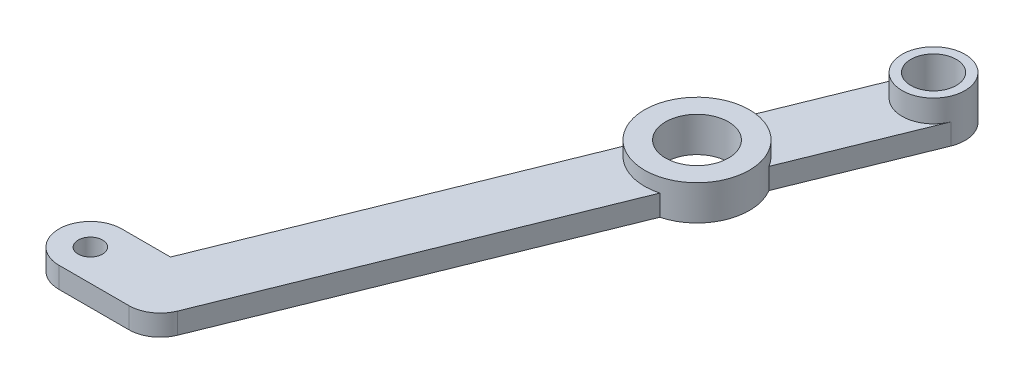
ISO-10303-21;
HEADER;
FILE_DESCRIPTION(('STEP AP214'),'2;1');
FILE_NAME('part.step','',(''),(''),'','','');
FILE_SCHEMA(('AUTOMOTIVE_DESIGN { 1 0 10303 214 1 1 1 1 }'));
ENDSEC;
DATA;
#1=APPLICATION_CONTEXT('core data for automotive mechanical design processes');
#2=APPLICATION_PROTOCOL_DEFINITION('international standard','automotive_design',2000,#1);
#3=PRODUCT_CONTEXT('',#1,'mechanical');
#4=PRODUCT('Part','Part','',(#3));
#5=PRODUCT_RELATED_PRODUCT_CATEGORY('part','',(#4));
#6=PRODUCT_DEFINITION_FORMATION('','',#4);
#7=PRODUCT_DEFINITION_CONTEXT('part definition',#1,'design');
#8=PRODUCT_DEFINITION('design','',#6,#7);
#9=PRODUCT_DEFINITION_SHAPE('','',#8);
#10=(LENGTH_UNIT() NAMED_UNIT(*) SI_UNIT(.MILLI.,.METRE.));
#11=(NAMED_UNIT(*) PLANE_ANGLE_UNIT() SI_UNIT($,.RADIAN.));
#12=(NAMED_UNIT(*) SI_UNIT($,.STERADIAN.) SOLID_ANGLE_UNIT());
#13=UNCERTAINTY_MEASURE_WITH_UNIT(LENGTH_MEASURE(1.E-05),#10,'distance_accuracy_value','');
#14=(GEOMETRIC_REPRESENTATION_CONTEXT(3) GLOBAL_UNCERTAINTY_ASSIGNED_CONTEXT((#13)) GLOBAL_UNIT_ASSIGNED_CONTEXT((#10,
#11,#12)) REPRESENTATION_CONTEXT('',''));
#15=CARTESIAN_POINT('',(0.,0.,0.));
#16=DIRECTION('',(0.,0.,1.));
#17=DIRECTION('',(1.,0.,0.));
#18=AXIS2_PLACEMENT_3D('',#15,#16,#17);
#19=CARTESIAN_POINT('',(0.,3.,0.));
#20=DIRECTION('',(0.,1.,0.));
#21=DIRECTION('',(0.,0.,1.));
#22=AXIS2_PLACEMENT_3D('',#19,#20,#21);
#23=PLANE('',#22);
#24=DIRECTION('',(-0.375214602844968,0.,0.926937970854519));
#25=VECTOR('',#24,1.);
#26=CARTESIAN_POINT('',(4.42091914927362,3.,1.78954091315865));
#27=LINE('',#26,#25);
#28=CARTESIAN_POINT('',(37.722020372977,3.,-80.4781932354364));
#29=VERTEX_POINT('',#28);
#30=CARTESIAN_POINT('',(30.2177283160777,3.,-61.9394338183461));
#31=VERTEX_POINT('',#30);
#32=EDGE_CURVE('E145',#29,#31,#27,.T.);
#33=ORIENTED_EDGE('',*,*,#32,.T.);
#34=CARTESIAN_POINT('',(32.1376615678532,3.,-54.6893402804166));
#35=DIRECTION('',(0.,1.,0.));
#36=DIRECTION('',(0.,0.,1.));
#37=AXIS2_PLACEMENT_3D('',#34,#35,#36);
#38=CIRCLE('',#37,7.49999999999999);
#39=CARTESIAN_POINT('',(38.5601700537683,3.,-58.5625023927414));
#40=VERTEX_POINT('',#39);
#41=EDGE_CURVE('E56',#40,#31,#38,.T.);
#42=ORIENTED_EDGE('',*,*,#41,.F.);
#43=DIRECTION('',(0.375214602844968,0.,-0.926937970854519));
#44=VECTOR('',#43,1.);
#45=CARTESIAN_POINT('',(12.7633608869643,3.,5.16647233876335));
#46=LINE('',#45,#44);
#47=CARTESIAN_POINT('',(46.0644621106676,3.,-77.1012618098317));
#48=VERTEX_POINT('',#47);
#49=EDGE_CURVE('E142',#40,#48,#46,.T.);
#50=ORIENTED_EDGE('',*,*,#49,.T.);
#51=CARTESIAN_POINT('',(41.8932412418223,3.,-78.7897275226341));
#52=DIRECTION('',(0.,1.,0.));
#53=DIRECTION('',(0.,0.,1.));
#54=AXIS2_PLACEMENT_3D('',#51,#52,#53);
#55=CIRCLE('',#54,4.49999999999999);
#56=EDGE_CURVE('E192',#29,#48,#55,.T.);
#57=ORIENTED_EDGE('',*,*,#56,.F.);
#58=EDGE_LOOP('',(#33,#42,#50,#57));
#59=FACE_BOUND('',#58,.T.);
#60=ADVANCED_FACE('F34',(#59),#23,.T.);
#61=CARTESIAN_POINT('',(0.,3.,0.));
#62=DIRECTION('',(0.,1.,0.));
#63=DIRECTION('',(0.,0.,1.));
#64=AXIS2_PLACEMENT_3D('',#61,#62,#63);
#65=CIRCLE('',#64,1.75);
#66=CARTESIAN_POINT('',(0.,3.,1.75));
#67=VERTEX_POINT('',#66);
#68=EDGE_CURVE('E162',#67,#67,#65,.T.);
#69=ORIENTED_EDGE('',*,*,#68,.F.);
#70=EDGE_LOOP('',(#69));
#71=FACE_BOUND('',#70,.T.);
#72=CARTESIAN_POINT('',(14.1712208688453,3.,1.68846571280235));
#73=VERTEX_POINT('',#72);
#74=CARTESIAN_POINT('',(34.0575948196287,3.,-47.4392467424871));
#75=VERTEX_POINT('',#74);
#76=EDGE_CURVE('E133',#73,#75,#46,.T.);
#77=ORIENTED_EDGE('',*,*,#76,.T.);
#78=CARTESIAN_POINT('',(25.715153081938,3.,-50.8161781680919));
#79=VERTEX_POINT('',#78);
#80=EDGE_CURVE('E115',#79,#75,#38,.T.);
#81=ORIENTED_EDGE('',*,*,#80,.F.);
#82=CARTESIAN_POINT('',(6.96685821964362,3.,-4.5));
#83=VERTEX_POINT('',#82);
#84=EDGE_CURVE('E230',#79,#83,#27,.T.);
#85=ORIENTED_EDGE('',*,*,#84,.T.);
#86=DIRECTION('',(1.,0.,0.));
#87=VECTOR('',#86,1.);
#88=CARTESIAN_POINT('',(0.,3.,-4.5));
#89=LINE('',#88,#87);
#90=CARTESIAN_POINT('',(0.,3.,-4.5));
#91=VERTEX_POINT('',#90);
#92=EDGE_CURVE('E172',#91,#83,#89,.T.);
#93=ORIENTED_EDGE('',*,*,#92,.F.);
#94=CARTESIAN_POINT('',(0.,3.,0.));
#95=DIRECTION('',(0.,1.,0.));
#96=DIRECTION('',(0.,0.,1.));
#97=AXIS2_PLACEMENT_3D('',#94,#95,#96);
#98=CIRCLE('',#97,4.5);
#99=CARTESIAN_POINT('',(0.,3.,4.5));
#100=VERTEX_POINT('',#99);
#101=EDGE_CURVE('E165',#91,#100,#98,.T.);
#102=ORIENTED_EDGE('',*,*,#101,.T.);
#103=DIRECTION('',(-1.,0.,0.));
#104=VECTOR('',#103,1.);
#105=CARTESIAN_POINT('',(0.,3.,4.5));
#106=LINE('',#105,#104);
#107=CARTESIAN_POINT('',(10.,3.,4.5));
#108=VERTEX_POINT('',#107);
#109=EDGE_CURVE('E168',#108,#100,#106,.T.);
#110=ORIENTED_EDGE('',*,*,#109,.F.);
#111=CARTESIAN_POINT('',(10.,3.,0.));
#112=DIRECTION('',(0.,1.,0.));
#113=DIRECTION('',(0.,0.,1.));
#114=AXIS2_PLACEMENT_3D('',#111,#112,#113);
#115=CIRCLE('',#114,4.50000000000001);
#116=EDGE_CURVE('E140',#108,#73,#115,.T.);
#117=ORIENTED_EDGE('',*,*,#116,.T.);
#118=EDGE_LOOP('',(#77,#81,#85,#93,#102,#110,#117));
#119=FACE_BOUND('',#118,.T.);
#120=ADVANCED_FACE('F137',(#71,#119),#23,.T.);
#121=CARTESIAN_POINT('',(4.42091914927362,0.,1.78954091315865));
#122=DIRECTION('',(-0.926937970854519,0.,-0.375214602844968));
#123=DIRECTION('',(-0.375214602844968,0.,0.926937970854519));
#124=AXIS2_PLACEMENT_3D('',#121,#122,#123);
#125=PLANE('',#124);
#126=DIRECTION('',(0.,-1.,0.));
#127=VECTOR('',#126,1.);
#128=CARTESIAN_POINT('',(30.2177283160776,3.,-61.9394338183461));
#129=LINE('',#128,#127);
#130=CARTESIAN_POINT('',(30.2177283160777,0.,-61.9394338183461));
#131=VERTEX_POINT('',#130);
#132=EDGE_CURVE('E221',#31,#131,#129,.T.);
#133=ORIENTED_EDGE('',*,*,#132,.F.);
#134=ORIENTED_EDGE('',*,*,#32,.F.);
#135=DIRECTION('',(0.,1.,0.));
#136=VECTOR('',#135,1.);
#137=CARTESIAN_POINT('',(37.722020372977,0.,-80.4781932354364));
#138=LINE('',#137,#136);
#139=CARTESIAN_POINT('',(37.722020372977,0.,-80.4781932354364));
#140=VERTEX_POINT('',#139);
#141=EDGE_CURVE('E149',#140,#29,#138,.T.);
#142=ORIENTED_EDGE('',*,*,#141,.F.);
#143=DIRECTION('',(-0.375214602844968,0.,0.926937970854519));
#144=VECTOR('',#143,1.);
#145=CARTESIAN_POINT('',(4.42091914927362,0.,1.78954091315865));
#146=LINE('',#145,#144);
#147=EDGE_CURVE('E49',#140,#131,#146,.T.);
#148=ORIENTED_EDGE('',*,*,#147,.T.);
#149=EDGE_LOOP('',(#133,#134,#142,#148));
#150=FACE_BOUND('',#149,.T.);
#151=ADVANCED_FACE('F237',(#150),#125,.T.);
#152=CARTESIAN_POINT('',(12.7633608869643,0.,5.16647233876335));
#153=DIRECTION('',(0.926937970854519,0.,0.375214602844969));
#154=DIRECTION('',(0.375214602844969,0.,-0.926937970854519));
#155=AXIS2_PLACEMENT_3D('',#152,#153,#154);
#156=PLANE('',#155);
#157=DIRECTION('',(0.,-1.,0.));
#158=VECTOR('',#157,1.);
#159=CARTESIAN_POINT('',(34.0575948196287,3.,-47.4392467424871));
#160=LINE('',#159,#158);
#161=CARTESIAN_POINT('',(34.0575948196287,0.,-47.4392467424871));
#162=VERTEX_POINT('',#161);
#163=EDGE_CURVE('E11',#75,#162,#160,.T.);
#164=ORIENTED_EDGE('',*,*,#163,.F.);
#165=ORIENTED_EDGE('',*,*,#76,.F.);
#166=DIRECTION('',(0.,1.,0.));
#167=VECTOR('',#166,1.);
#168=CARTESIAN_POINT('',(14.1712208688453,0.,1.68846571280236));
#169=LINE('',#168,#167);
#170=CARTESIAN_POINT('',(14.1712208688453,0.,1.68846571280235));
#171=VERTEX_POINT('',#170);
#172=EDGE_CURVE('E156',#171,#73,#169,.T.);
#173=ORIENTED_EDGE('',*,*,#172,.F.);
#174=DIRECTION('',(0.375214602844968,0.,-0.926937970854519));
#175=VECTOR('',#174,1.);
#176=CARTESIAN_POINT('',(12.7633608869643,0.,5.16647233876335));
#177=LINE('',#176,#175);
#178=EDGE_CURVE('E135',#171,#162,#177,.T.);
#179=ORIENTED_EDGE('',*,*,#178,.T.);
#180=EDGE_LOOP('',(#164,#165,#173,#179));
#181=FACE_BOUND('',#180,.T.);
#182=ADVANCED_FACE('F131',(#181),#156,.T.);
#183=CARTESIAN_POINT('',(0.,3.,0.));
#184=DIRECTION('',(0.,-1.,0.));
#185=DIRECTION('',(0.,0.,-1.));
#186=AXIS2_PLACEMENT_3D('',#183,#184,#185);
#187=CYLINDRICAL_SURFACE('',#186,4.5);
#188=CARTESIAN_POINT('',(0.,0.,0.));
#189=DIRECTION('',(0.,1.,0.));
#190=DIRECTION('',(0.,0.,1.));
#191=AXIS2_PLACEMENT_3D('',#188,#189,#190);
#192=CIRCLE('',#191,4.5);
#193=CARTESIAN_POINT('',(0.,0.,-4.5));
#194=VERTEX_POINT('',#193);
#195=CARTESIAN_POINT('',(0.,0.,4.5));
#196=VERTEX_POINT('',#195);
#197=EDGE_CURVE('E178',#194,#196,#192,.T.);
#198=ORIENTED_EDGE('',*,*,#197,.T.);
#199=DIRECTION('',(0.,-1.,0.));
#200=VECTOR('',#199,1.);
#201=CARTESIAN_POINT('',(0.,3.,4.5));
#202=LINE('',#201,#200);
#203=EDGE_CURVE('E191',#100,#196,#202,.T.);
#204=ORIENTED_EDGE('',*,*,#203,.F.);
#205=ORIENTED_EDGE('',*,*,#101,.F.);
#206=DIRECTION('',(0.,-1.,0.));
#207=VECTOR('',#206,1.);
#208=CARTESIAN_POINT('',(0.,3.,-4.5));
#209=LINE('',#208,#207);
#210=EDGE_CURVE('E175',#91,#194,#209,.T.);
#211=ORIENTED_EDGE('',*,*,#210,.T.);
#212=EDGE_LOOP('',(#198,#204,#205,#211));
#213=FACE_BOUND('',#212,.T.);
#214=ADVANCED_FACE('F245',(#213),#187,.T.);
#215=CARTESIAN_POINT('',(0.,3.,4.5));
#216=DIRECTION('',(0.,0.,1.));
#217=DIRECTION('',(1.,0.,0.));
#218=AXIS2_PLACEMENT_3D('',#215,#216,#217);
#219=PLANE('',#218);
#220=DIRECTION('',(-1.,0.,0.));
#221=VECTOR('',#220,1.);
#222=CARTESIAN_POINT('',(0.,0.,4.5));
#223=LINE('',#222,#221);
#224=CARTESIAN_POINT('',(10.,0.,4.5));
#225=VERTEX_POINT('',#224);
#226=EDGE_CURVE('E181',#225,#196,#223,.T.);
#227=ORIENTED_EDGE('',*,*,#226,.F.);
#228=DIRECTION('',(0.,-1.,0.));
#229=VECTOR('',#228,1.);
#230=CARTESIAN_POINT('',(10.,3.,4.5));
#231=LINE('',#230,#229);
#232=EDGE_CURVE('E189',#108,#225,#231,.T.);
#233=ORIENTED_EDGE('',*,*,#232,.F.);
#234=ORIENTED_EDGE('',*,*,#109,.T.);
#235=ORIENTED_EDGE('',*,*,#203,.T.);
#236=EDGE_LOOP('',(#227,#233,#234,#235));
#237=FACE_BOUND('',#236,.T.);
#238=ADVANCED_FACE('F268',(#237),#219,.T.);
#239=CARTESIAN_POINT('',(10.,3.,0.));
#240=DIRECTION('',(0.,-1.,0.));
#241=DIRECTION('',(0.,0.,-1.));
#242=AXIS2_PLACEMENT_3D('',#239,#240,#241);
#243=CYLINDRICAL_SURFACE('',#242,4.50000000000001);
#244=CARTESIAN_POINT('',(10.,0.,0.));
#245=DIRECTION('',(0.,1.,0.));
#246=DIRECTION('',(0.,0.,1.));
#247=AXIS2_PLACEMENT_3D('',#244,#245,#246);
#248=CIRCLE('',#247,4.50000000000001);
#249=EDGE_CURVE('E184',#225,#171,#248,.T.);
#250=ORIENTED_EDGE('',*,*,#249,.T.);
#251=ORIENTED_EDGE('',*,*,#172,.T.);
#252=ORIENTED_EDGE('',*,*,#116,.F.);
#253=ORIENTED_EDGE('',*,*,#232,.T.);
#254=EDGE_LOOP('',(#250,#251,#252,#253));
#255=FACE_BOUND('',#254,.T.);
#256=ADVANCED_FACE('F265',(#255),#243,.T.);
#257=CARTESIAN_POINT('',(0.,3.,0.));
#258=DIRECTION('',(0.,-1.,0.));
#259=DIRECTION('',(0.,0.,-1.));
#260=AXIS2_PLACEMENT_3D('',#257,#258,#259);
#261=CYLINDRICAL_SURFACE('',#260,1.75);
#262=ORIENTED_EDGE('',*,*,#68,.T.);
#263=EDGE_LOOP('',(#262));
#264=FACE_BOUND('',#263,.T.);
#265=CARTESIAN_POINT('',(0.,0.,0.));
#266=DIRECTION('',(0.,1.,0.));
#267=DIRECTION('',(0.,0.,1.));
#268=AXIS2_PLACEMENT_3D('',#265,#266,#267);
#269=CIRCLE('',#268,1.75);
#270=CARTESIAN_POINT('',(0.,0.,1.75));
#271=VERTEX_POINT('',#270);
#272=EDGE_CURVE('E152',#271,#271,#269,.T.);
#273=ORIENTED_EDGE('',*,*,#272,.F.);
#274=EDGE_LOOP('',(#273));
#275=FACE_BOUND('',#274,.T.);
#276=ADVANCED_FACE('F36',(#264,#275),#261,.F.);
#277=CARTESIAN_POINT('',(0.,3.,-4.5));
#278=DIRECTION('',(0.,0.,-1.));
#279=DIRECTION('',(-1.,0.,0.));
#280=AXIS2_PLACEMENT_3D('',#277,#278,#279);
#281=PLANE('',#280);
#282=DIRECTION('',(0.,1.,0.));
#283=VECTOR('',#282,1.);
#284=CARTESIAN_POINT('',(6.96685821964361,0.,-4.5));
#285=LINE('',#284,#283);
#286=CARTESIAN_POINT('',(6.96685821964362,0.,-4.5));
#287=VERTEX_POINT('',#286);
#288=EDGE_CURVE('E158',#287,#83,#285,.T.);
#289=ORIENTED_EDGE('',*,*,#288,.F.);
#290=DIRECTION('',(1.,0.,0.));
#291=VECTOR('',#290,1.);
#292=CARTESIAN_POINT('',(0.,0.,-4.5));
#293=LINE('',#292,#291);
#294=EDGE_CURVE('E166',#194,#287,#293,.T.);
#295=ORIENTED_EDGE('',*,*,#294,.F.);
#296=ORIENTED_EDGE('',*,*,#210,.F.);
#297=ORIENTED_EDGE('',*,*,#92,.T.);
#298=EDGE_LOOP('',(#289,#295,#296,#297));
#299=FACE_BOUND('',#298,.T.);
#300=ADVANCED_FACE('F260',(#299),#281,.T.);
#301=CARTESIAN_POINT('',(0.,0.,0.));
#302=DIRECTION('',(0.,1.,0.));
#303=DIRECTION('',(0.,0.,1.));
#304=AXIS2_PLACEMENT_3D('',#301,#302,#303);
#305=PLANE('',#304);
#306=CARTESIAN_POINT('',(32.1376615678532,0.,-54.6893402804166));
#307=DIRECTION('',(0.,-1.,0.));
#308=DIRECTION('',(0.,0.,-1.));
#309=AXIS2_PLACEMENT_3D('',#306,#307,#308);
#310=CIRCLE('',#309,4.5);
#311=CARTESIAN_POINT('',(32.1376615678532,0.,-59.1893402804166));
#312=VERTEX_POINT('',#311);
#313=EDGE_CURVE('E214',#312,#312,#310,.T.);
#314=ORIENTED_EDGE('',*,*,#313,.F.);
#315=EDGE_LOOP('',(#314));
#316=FACE_BOUND('',#315,.T.);
#317=ORIENTED_EDGE('',*,*,#272,.T.);
#318=EDGE_LOOP('',(#317));
#319=FACE_BOUND('',#318,.T.);
#320=CARTESIAN_POINT('',(25.715153081938,0.,-50.8161781680918));
#321=VERTEX_POINT('',#320);
#322=EDGE_CURVE('E141',#321,#287,#146,.T.);
#323=ORIENTED_EDGE('',*,*,#322,.F.);
#324=CARTESIAN_POINT('',(32.1376615678531,0.,-54.6893402804166));
#325=DIRECTION('',(0.,-1.,0.));
#326=DIRECTION('',(0.,0.,-1.));
#327=AXIS2_PLACEMENT_3D('',#324,#325,#326);
#328=CIRCLE('',#327,7.5);
#329=EDGE_CURVE('E212',#321,#131,#328,.T.);
#330=ORIENTED_EDGE('',*,*,#329,.T.);
#331=ORIENTED_EDGE('',*,*,#147,.F.);
#332=CARTESIAN_POINT('',(41.8932412418223,0.,-78.7897275226341));
#333=DIRECTION('',(0.,1.,0.));
#334=DIRECTION('',(0.,0.,1.));
#335=AXIS2_PLACEMENT_3D('',#332,#333,#334);
#336=CIRCLE('',#335,4.50000000000001);
#337=CARTESIAN_POINT('',(46.0644621106677,0.,-77.1012618098318));
#338=VERTEX_POINT('',#337);
#339=EDGE_CURVE('E161',#338,#140,#336,.T.);
#340=ORIENTED_EDGE('',*,*,#339,.F.);
#341=CARTESIAN_POINT('',(38.5601700537683,0.,-58.5625023927414));
#342=VERTEX_POINT('',#341);
#343=EDGE_CURVE('E202',#342,#338,#177,.T.);
#344=ORIENTED_EDGE('',*,*,#343,.F.);
#345=EDGE_CURVE('E213',#342,#162,#328,.T.);
#346=ORIENTED_EDGE('',*,*,#345,.T.);
#347=ORIENTED_EDGE('',*,*,#178,.F.);
#348=ORIENTED_EDGE('',*,*,#249,.F.);
#349=ORIENTED_EDGE('',*,*,#226,.T.);
#350=ORIENTED_EDGE('',*,*,#197,.F.);
#351=ORIENTED_EDGE('',*,*,#294,.T.);
#352=EDGE_LOOP('',(#323,#330,#331,#340,#344,#346,#347,#348,#349,#350,#351));
#353=FACE_BOUND('',#352,.T.);
#354=CARTESIAN_POINT('',(41.8932412418223,0.,-78.7897275226341));
#355=DIRECTION('',(0.,1.,0.));
#356=DIRECTION('',(0.,0.,1.));
#357=AXIS2_PLACEMENT_3D('',#354,#355,#356);
#358=CIRCLE('',#357,3.25);
#359=CARTESIAN_POINT('',(41.8932412418223,0.,-75.5397275226341));
#360=VERTEX_POINT('',#359);
#361=EDGE_CURVE('E223',#360,#360,#358,.T.);
#362=ORIENTED_EDGE('',*,*,#361,.T.);
#363=EDGE_LOOP('',(#362));
#364=FACE_BOUND('',#363,.T.);
#365=ADVANCED_FACE('F209',(#316,#319,#353,#364),#305,.F.);
#366=DIRECTION('',(0.,-1.,0.));
#367=VECTOR('',#366,1.);
#368=CARTESIAN_POINT('',(25.715153081938,3.,-50.8161781680918));
#369=LINE('',#368,#367);
#370=EDGE_CURVE('E123',#321,#79,#369,.F.);
#371=ORIENTED_EDGE('',*,*,#370,.F.);
#372=ORIENTED_EDGE('',*,*,#322,.T.);
#373=ORIENTED_EDGE('',*,*,#288,.T.);
#374=ORIENTED_EDGE('',*,*,#84,.F.);
#375=EDGE_LOOP('',(#371,#372,#373,#374));
#376=FACE_BOUND('',#375,.T.);
#377=ADVANCED_FACE('F240',(#376),#125,.T.);
#378=CARTESIAN_POINT('',(41.8932412418223,0.,-78.7897275226341));
#379=DIRECTION('',(0.,1.,0.));
#380=DIRECTION('',(0.,0.,1.));
#381=AXIS2_PLACEMENT_3D('',#378,#379,#380);
#382=CYLINDRICAL_SURFACE('',#381,4.50000000000001);
#383=ORIENTED_EDGE('',*,*,#141,.T.);
#384=ORIENTED_EDGE('',*,*,#56,.T.);
#385=DIRECTION('',(0.,1.,0.));
#386=VECTOR('',#385,1.);
#387=CARTESIAN_POINT('',(46.0644621106677,0.,-77.1012618098318));
#388=LINE('',#387,#386);
#389=EDGE_CURVE('E153',#338,#48,#388,.T.);
#390=ORIENTED_EDGE('',*,*,#389,.F.);
#391=ORIENTED_EDGE('',*,*,#339,.T.);
#392=EDGE_LOOP('',(#383,#384,#390,#391));
#393=FACE_BOUND('',#392,.T.);
#394=CARTESIAN_POINT('',(41.8932412418223,6.2,-78.7897275226341));
#395=DIRECTION('',(0.,1.,0.));
#396=DIRECTION('',(0.,0.,1.));
#397=AXIS2_PLACEMENT_3D('',#394,#395,#396);
#398=CIRCLE('',#397,4.49999999999999);
#399=CARTESIAN_POINT('',(41.8932412418223,6.2,-74.2897275226341));
#400=VERTEX_POINT('',#399);
#401=EDGE_CURVE('E199',#400,#400,#398,.T.);
#402=ORIENTED_EDGE('',*,*,#401,.F.);
#403=EDGE_LOOP('',(#402));
#404=FACE_BOUND('',#403,.T.);
#405=ADVANCED_FACE('F205',(#393,#404),#382,.T.);
#406=DIRECTION('',(0.,-1.,0.));
#407=VECTOR('',#406,1.);
#408=CARTESIAN_POINT('',(38.5601700537683,3.,-58.5625023927414));
#409=LINE('',#408,#407);
#410=EDGE_CURVE('E42',#342,#40,#409,.F.);
#411=ORIENTED_EDGE('',*,*,#410,.F.);
#412=ORIENTED_EDGE('',*,*,#343,.T.);
#413=ORIENTED_EDGE('',*,*,#389,.T.);
#414=ORIENTED_EDGE('',*,*,#49,.F.);
#415=EDGE_LOOP('',(#411,#412,#413,#414));
#416=FACE_BOUND('',#415,.T.);
#417=ADVANCED_FACE('F247',(#416),#156,.T.);
#418=CARTESIAN_POINT('',(41.8932412418223,6.2,-78.7897275226341));
#419=DIRECTION('',(0.,1.,0.));
#420=DIRECTION('',(0.,0.,1.));
#421=AXIS2_PLACEMENT_3D('',#418,#419,#420);
#422=PLANE('',#421);
#423=ORIENTED_EDGE('',*,*,#401,.T.);
#424=EDGE_LOOP('',(#423));
#425=FACE_BOUND('',#424,.T.);
#426=CARTESIAN_POINT('',(41.8932412418223,6.2,-78.7897275226341));
#427=DIRECTION('',(0.,1.,0.));
#428=DIRECTION('',(0.,0.,1.));
#429=AXIS2_PLACEMENT_3D('',#426,#427,#428);
#430=CIRCLE('',#429,3.25);
#431=CARTESIAN_POINT('',(41.8932412418223,6.2,-75.5397275226341));
#432=VERTEX_POINT('',#431);
#433=EDGE_CURVE('E225',#432,#432,#430,.T.);
#434=ORIENTED_EDGE('',*,*,#433,.F.);
#435=EDGE_LOOP('',(#434));
#436=FACE_BOUND('',#435,.T.);
#437=ADVANCED_FACE('F322',(#425,#436),#422,.T.);
#438=CARTESIAN_POINT('',(41.8932412418223,6.2,-78.7897275226341));
#439=DIRECTION('',(0.,-1.,0.));
#440=DIRECTION('',(0.,0.,-1.));
#441=AXIS2_PLACEMENT_3D('',#438,#439,#440);
#442=CYLINDRICAL_SURFACE('',#441,3.25);
#443=ORIENTED_EDGE('',*,*,#433,.T.);
#444=EDGE_LOOP('',(#443));
#445=FACE_BOUND('',#444,.T.);
#446=ORIENTED_EDGE('',*,*,#361,.F.);
#447=EDGE_LOOP('',(#446));
#448=FACE_BOUND('',#447,.T.);
#449=ADVANCED_FACE('F353',(#445,#448),#442,.F.);
#450=CARTESIAN_POINT('',(32.1376615678531,3.,-54.6893402804166));
#451=DIRECTION('',(0.,-1.,0.));
#452=DIRECTION('',(0.,0.,-1.));
#453=AXIS2_PLACEMENT_3D('',#450,#451,#452);
#454=CYLINDRICAL_SURFACE('',#453,7.5);
#455=ORIENTED_EDGE('',*,*,#370,.T.);
#456=ORIENTED_EDGE('',*,*,#80,.T.);
#457=ORIENTED_EDGE('',*,*,#163,.T.);
#458=ORIENTED_EDGE('',*,*,#345,.F.);
#459=ORIENTED_EDGE('',*,*,#410,.T.);
#460=ORIENTED_EDGE('',*,*,#41,.T.);
#461=ORIENTED_EDGE('',*,*,#132,.T.);
#462=ORIENTED_EDGE('',*,*,#329,.F.);
#463=EDGE_LOOP('',(#455,#456,#457,#458,#459,#460,#461,#462));
#464=FACE_BOUND('',#463,.T.);
#465=CARTESIAN_POINT('',(32.1376615678532,5.,-54.6893402804166));
#466=DIRECTION('',(0.,1.,0.));
#467=DIRECTION('',(0.,0.,1.));
#468=AXIS2_PLACEMENT_3D('',#465,#466,#467);
#469=CIRCLE('',#468,7.49999999999999);
#470=CARTESIAN_POINT('',(32.1376615678532,5.,-47.1893402804166));
#471=VERTEX_POINT('',#470);
#472=EDGE_CURVE('E217',#471,#471,#469,.T.);
#473=ORIENTED_EDGE('',*,*,#472,.F.);
#474=EDGE_LOOP('',(#473));
#475=FACE_BOUND('',#474,.T.);
#476=ADVANCED_FACE('F117',(#464,#475),#454,.T.);
#477=CARTESIAN_POINT('',(32.1376615678532,6.2,-54.6893402804166));
#478=DIRECTION('',(0.,-1.,0.));
#479=DIRECTION('',(0.,0.,-1.));
#480=AXIS2_PLACEMENT_3D('',#477,#478,#479);
#481=CYLINDRICAL_SURFACE('',#480,4.5);
#482=ORIENTED_EDGE('',*,*,#313,.T.);
#483=EDGE_LOOP('',(#482));
#484=FACE_BOUND('',#483,.T.);
#485=CARTESIAN_POINT('',(32.1376615678532,5.,-54.6893402804166));
#486=DIRECTION('',(0.,1.,0.));
#487=DIRECTION('',(0.,0.,1.));
#488=AXIS2_PLACEMENT_3D('',#485,#486,#487);
#489=CIRCLE('',#488,4.5);
#490=CARTESIAN_POINT('',(32.1376615678532,5.,-50.1893402804166));
#491=VERTEX_POINT('',#490);
#492=EDGE_CURVE('E127',#491,#491,#489,.T.);
#493=ORIENTED_EDGE('',*,*,#492,.T.);
#494=EDGE_LOOP('',(#493));
#495=FACE_BOUND('',#494,.T.);
#496=ADVANCED_FACE('F352',(#484,#495),#481,.F.);
#497=CARTESIAN_POINT('',(32.1376615678532,5.,-54.6893402804166));
#498=DIRECTION('',(0.,1.,0.));
#499=DIRECTION('',(0.,0.,1.));
#500=AXIS2_PLACEMENT_3D('',#497,#498,#499);
#501=PLANE('',#500);
#502=ORIENTED_EDGE('',*,*,#472,.T.);
#503=EDGE_LOOP('',(#502));
#504=FACE_BOUND('',#503,.T.);
#505=ORIENTED_EDGE('',*,*,#492,.F.);
#506=EDGE_LOOP('',(#505));
#507=FACE_BOUND('',#506,.T.);
#508=ADVANCED_FACE('F363',(#504,#507),#501,.T.);
#509=CLOSED_SHELL('',(#60,#120,#151,#182,#214,#238,#256,#276,#300,#365,#377,#405,#417,#437,#449,
#476,#496,#508));
#510=MANIFOLD_SOLID_BREP('B2',#509);
#511=ADVANCED_BREP_SHAPE_REPRESENTATION('',(#18,#510),#14);
#512=SHAPE_DEFINITION_REPRESENTATION(#9,#511);
ENDSEC;
END-ISO-10303-21;
